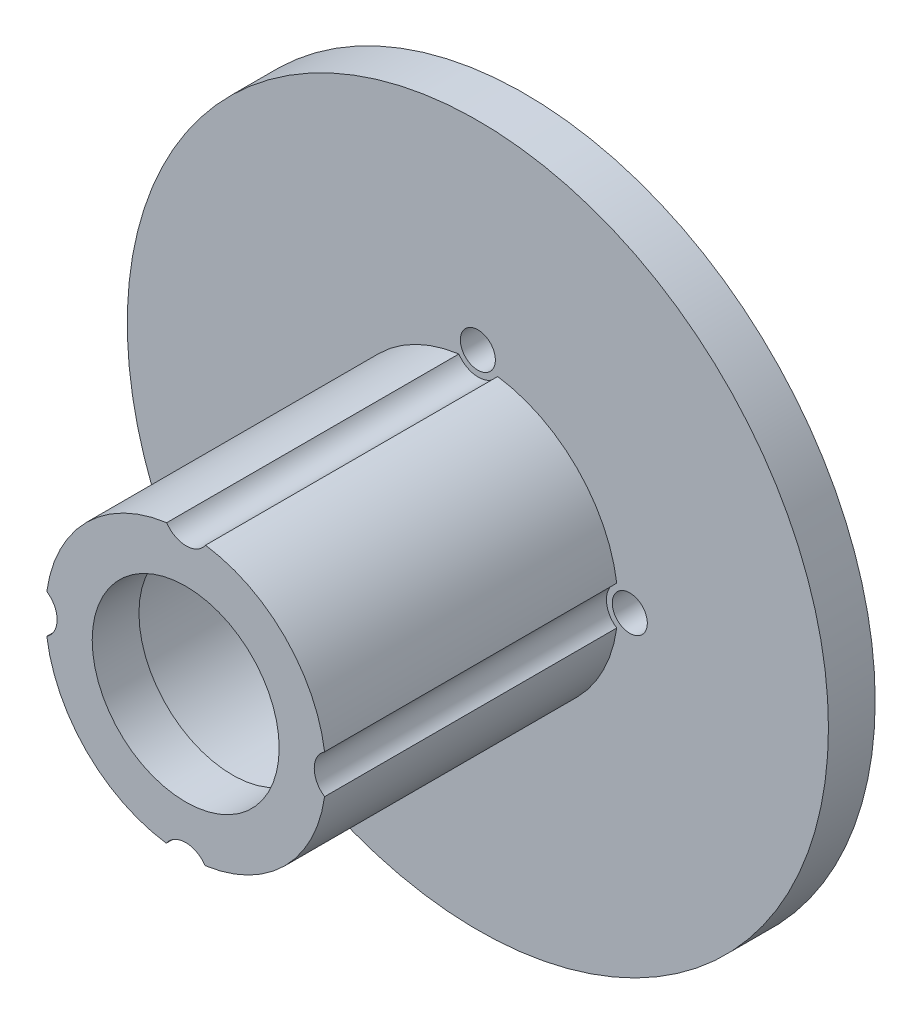
ISO-10303-21;
HEADER;
FILE_DESCRIPTION(('STEP AP214'),'2;1');
FILE_NAME('part.step','',(''),(''),'','','');
FILE_SCHEMA(('AUTOMOTIVE_DESIGN { 1 0 10303 214 1 1 1 1 }'));
ENDSEC;
DATA;
#1=APPLICATION_CONTEXT('core data for automotive mechanical design processes');
#2=APPLICATION_PROTOCOL_DEFINITION('international standard','automotive_design',2000,#1);
#3=PRODUCT_CONTEXT('',#1,'mechanical');
#4=PRODUCT('Part','Part','',(#3));
#5=PRODUCT_RELATED_PRODUCT_CATEGORY('part','',(#4));
#6=PRODUCT_DEFINITION_FORMATION('','',#4);
#7=PRODUCT_DEFINITION_CONTEXT('part definition',#1,'design');
#8=PRODUCT_DEFINITION('design','',#6,#7);
#9=PRODUCT_DEFINITION_SHAPE('','',#8);
#10=(LENGTH_UNIT() NAMED_UNIT(*) SI_UNIT(.MILLI.,.METRE.));
#11=(NAMED_UNIT(*) PLANE_ANGLE_UNIT() SI_UNIT($,.RADIAN.));
#12=(NAMED_UNIT(*) SI_UNIT($,.STERADIAN.) SOLID_ANGLE_UNIT());
#13=UNCERTAINTY_MEASURE_WITH_UNIT(LENGTH_MEASURE(1.E-05),#10,'distance_accuracy_value','');
#14=(GEOMETRIC_REPRESENTATION_CONTEXT(3) GLOBAL_UNCERTAINTY_ASSIGNED_CONTEXT((#13)) GLOBAL_UNIT_ASSIGNED_CONTEXT((#10,
#11,#12)) REPRESENTATION_CONTEXT('',''));
#15=CARTESIAN_POINT('',(0.,0.,0.));
#16=DIRECTION('',(0.,0.,1.));
#17=DIRECTION('',(1.,0.,0.));
#18=AXIS2_PLACEMENT_3D('',#15,#16,#17);
#19=CARTESIAN_POINT('',(0.,0.,29.));
#20=DIRECTION('',(0.,0.,-1.));
#21=DIRECTION('',(-1.,0.,0.));
#22=AXIS2_PLACEMENT_3D('',#19,#20,#21);
#23=CYLINDRICAL_SURFACE('',#22,12.);
#24=CARTESIAN_POINT('',(0.,0.,4.));
#25=DIRECTION('',(0.,0.,1.));
#26=DIRECTION('',(1.,0.,0.));
#27=AXIS2_PLACEMENT_3D('',#24,#25,#26);
#28=CIRCLE('',#27,12.);
#29=CARTESIAN_POINT('',(-11.8846153846154,-1.66009552730056,4.));
#30=VERTEX_POINT('',#29);
#31=CARTESIAN_POINT('',(-1.66009552730056,-11.8846153846154,4.));
#32=VERTEX_POINT('',#31);
#33=EDGE_CURVE('E114',#30,#32,#28,.T.);
#34=ORIENTED_EDGE('',*,*,#33,.T.);
#35=DIRECTION('',(0.,0.,1.));
#36=VECTOR('',#35,1.);
#37=CARTESIAN_POINT('',(-1.66009552730056,-11.8846153846154,16.5));
#38=LINE('',#37,#36);
#39=CARTESIAN_POINT('',(-1.66009552730056,-11.8846153846154,29.));
#40=VERTEX_POINT('',#39);
#41=EDGE_CURVE('E168',#32,#40,#38,.T.);
#42=ORIENTED_EDGE('',*,*,#41,.T.);
#43=CARTESIAN_POINT('',(0.,0.,29.));
#44=DIRECTION('',(0.,0.,1.));
#45=DIRECTION('',(1.,0.,0.));
#46=AXIS2_PLACEMENT_3D('',#43,#44,#45);
#47=CIRCLE('',#46,12.);
#48=CARTESIAN_POINT('',(-11.8846153846154,-1.66009552730056,29.));
#49=VERTEX_POINT('',#48);
#50=EDGE_CURVE('E116',#49,#40,#47,.T.);
#51=ORIENTED_EDGE('',*,*,#50,.F.);
#52=DIRECTION('',(0.,0.,1.));
#53=VECTOR('',#52,1.);
#54=CARTESIAN_POINT('',(-11.8846153846154,-1.66009552730056,16.5));
#55=LINE('',#54,#53);
#56=EDGE_CURVE('E100',#49,#30,#55,.F.);
#57=ORIENTED_EDGE('',*,*,#56,.T.);
#58=EDGE_LOOP('',(#34,#42,#51,#57));
#59=FACE_BOUND('',#58,.T.);
#60=ADVANCED_FACE('F33',(#59),#23,.T.);
#61=CARTESIAN_POINT('',(1.66009552730056,-11.8846153846154,29.));
#62=VERTEX_POINT('',#61);
#63=CARTESIAN_POINT('',(11.8846153846154,-1.66009552730056,29.));
#64=VERTEX_POINT('',#63);
#65=EDGE_CURVE('E151',#62,#64,#47,.T.);
#66=ORIENTED_EDGE('',*,*,#65,.F.);
#67=DIRECTION('',(0.,0.,1.));
#68=VECTOR('',#67,1.);
#69=CARTESIAN_POINT('',(1.66009552730056,-11.8846153846154,16.5));
#70=LINE('',#69,#68);
#71=CARTESIAN_POINT('',(1.66009552730056,-11.8846153846154,4.));
#72=VERTEX_POINT('',#71);
#73=EDGE_CURVE('E162',#62,#72,#70,.F.);
#74=ORIENTED_EDGE('',*,*,#73,.T.);
#75=CARTESIAN_POINT('',(11.8846153846154,-1.66009552730056,4.));
#76=VERTEX_POINT('',#75);
#77=EDGE_CURVE('E124',#72,#76,#28,.T.);
#78=ORIENTED_EDGE('',*,*,#77,.T.);
#79=DIRECTION('',(0.,0.,1.));
#80=VECTOR('',#79,1.);
#81=CARTESIAN_POINT('',(11.8846153846154,-1.66009552730056,16.5));
#82=LINE('',#81,#80);
#83=EDGE_CURVE('E163',#76,#64,#82,.T.);
#84=ORIENTED_EDGE('',*,*,#83,.T.);
#85=EDGE_LOOP('',(#66,#74,#78,#84));
#86=FACE_BOUND('',#85,.T.);
#87=ADVANCED_FACE('F161',(#86),#23,.T.);
#88=CARTESIAN_POINT('',(-1.62358319176585,11.8896584315705,4.));
#89=VERTEX_POINT('',#88);
#90=CARTESIAN_POINT('',(-11.8846153846154,1.66009552730056,4.));
#91=VERTEX_POINT('',#90);
#92=EDGE_CURVE('E123',#89,#91,#28,.T.);
#93=ORIENTED_EDGE('',*,*,#92,.T.);
#94=DIRECTION('',(0.,0.,1.));
#95=VECTOR('',#94,1.);
#96=CARTESIAN_POINT('',(-11.8846153846154,1.66009552730056,16.5));
#97=LINE('',#96,#95);
#98=CARTESIAN_POINT('',(-11.8846153846154,1.66009552730056,29.));
#99=VERTEX_POINT('',#98);
#100=EDGE_CURVE('E103',#91,#99,#97,.T.);
#101=ORIENTED_EDGE('',*,*,#100,.T.);
#102=CARTESIAN_POINT('',(-1.62358319176585,11.8896584315705,29.));
#103=VERTEX_POINT('',#102);
#104=EDGE_CURVE('E146',#103,#99,#47,.T.);
#105=ORIENTED_EDGE('',*,*,#104,.F.);
#106=DIRECTION('',(0.,0.,1.));
#107=VECTOR('',#106,1.);
#108=CARTESIAN_POINT('',(-1.62358319176585,11.8896584315705,16.5));
#109=LINE('',#108,#107);
#110=EDGE_CURVE('E55',#103,#89,#109,.F.);
#111=ORIENTED_EDGE('',*,*,#110,.T.);
#112=EDGE_LOOP('',(#93,#101,#105,#111));
#113=FACE_BOUND('',#112,.T.);
#114=ADVANCED_FACE('F225',(#113),#23,.T.);
#115=CARTESIAN_POINT('',(0.,0.,4.));
#116=DIRECTION('',(0.,0.,-1.));
#117=DIRECTION('',(-1.,0.,0.));
#118=AXIS2_PLACEMENT_3D('',#115,#116,#117);
#119=CYLINDRICAL_SURFACE('',#118,30.);
#120=CARTESIAN_POINT('',(0.,0.,4.));
#121=DIRECTION('',(0.,0.,1.));
#122=DIRECTION('',(1.,0.,0.));
#123=AXIS2_PLACEMENT_3D('',#120,#121,#122);
#124=CIRCLE('',#123,30.);
#125=CARTESIAN_POINT('',(30.,0.,4.));
#126=VERTEX_POINT('',#125);
#127=EDGE_CURVE('E41',#126,#126,#124,.T.);
#128=ORIENTED_EDGE('',*,*,#127,.F.);
#129=EDGE_LOOP('',(#128));
#130=FACE_BOUND('',#129,.T.);
#131=CARTESIAN_POINT('',(0.,0.,0.));
#132=DIRECTION('',(0.,0.,1.));
#133=DIRECTION('',(1.,0.,0.));
#134=AXIS2_PLACEMENT_3D('',#131,#132,#133);
#135=CIRCLE('',#134,30.);
#136=CARTESIAN_POINT('',(30.,0.,0.));
#137=VERTEX_POINT('',#136);
#138=EDGE_CURVE('E148',#137,#137,#135,.T.);
#139=ORIENTED_EDGE('',*,*,#138,.T.);
#140=EDGE_LOOP('',(#139));
#141=FACE_BOUND('',#140,.T.);
#142=ADVANCED_FACE('F35',(#130,#141),#119,.T.);
#143=CARTESIAN_POINT('',(0.,0.,4.));
#144=DIRECTION('',(0.,0.,1.));
#145=DIRECTION('',(1.,0.,0.));
#146=AXIS2_PLACEMENT_3D('',#143,#144,#145);
#147=PLANE('',#146);
#148=ORIENTED_EDGE('',*,*,#77,.F.);
#149=CARTESIAN_POINT('',(0.,-13.,4.));
#150=DIRECTION('',(0.,0.,1.));
#151=DIRECTION('',(1.,0.,0.));
#152=AXIS2_PLACEMENT_3D('',#149,#150,#151);
#153=CIRCLE('',#152,2.);
#154=EDGE_CURVE('E117',#32,#72,#153,.F.);
#155=ORIENTED_EDGE('',*,*,#154,.F.);
#156=ORIENTED_EDGE('',*,*,#33,.F.);
#157=CARTESIAN_POINT('',(-13.,0.,4.));
#158=DIRECTION('',(0.,0.,1.));
#159=DIRECTION('',(1.,0.,0.));
#160=AXIS2_PLACEMENT_3D('',#157,#158,#159);
#161=CIRCLE('',#160,2.);
#162=EDGE_CURVE('E97',#91,#30,#161,.F.);
#163=ORIENTED_EDGE('',*,*,#162,.F.);
#164=ORIENTED_EDGE('',*,*,#92,.F.);
#165=CARTESIAN_POINT('',(0.0398895616682176,13.,4.));
#166=DIRECTION('',(0.,0.,1.));
#167=DIRECTION('',(1.,0.,0.));
#168=AXIS2_PLACEMENT_3D('',#165,#166,#167);
#169=CIRCLE('',#168,2.);
#170=CARTESIAN_POINT('',(1.6965170496129,11.8794709436226,4.));
#171=VERTEX_POINT('',#170);
#172=EDGE_CURVE('E176',#171,#89,#169,.F.);
#173=ORIENTED_EDGE('',*,*,#172,.F.);
#174=CARTESIAN_POINT('',(11.8846153846154,1.66009552730056,4.));
#175=VERTEX_POINT('',#174);
#176=EDGE_CURVE('E126',#175,#171,#28,.T.);
#177=ORIENTED_EDGE('',*,*,#176,.F.);
#178=CARTESIAN_POINT('',(13.,0.,4.));
#179=DIRECTION('',(0.,0.,1.));
#180=DIRECTION('',(1.,0.,0.));
#181=AXIS2_PLACEMENT_3D('',#178,#179,#180);
#182=CIRCLE('',#181,2.);
#183=EDGE_CURVE('E356',#76,#175,#182,.F.);
#184=ORIENTED_EDGE('',*,*,#183,.F.);
#185=EDGE_LOOP('',(#148,#155,#156,#163,#164,#173,#177,#184));
#186=FACE_BOUND('',#185,.T.);
#187=ORIENTED_EDGE('',*,*,#127,.T.);
#188=EDGE_LOOP('',(#187));
#189=FACE_BOUND('',#188,.T.);
#190=CARTESIAN_POINT('',(0.,13.,4.));
#191=DIRECTION('',(0.,0.,-1.));
#192=DIRECTION('',(-1.,0.,0.));
#193=AXIS2_PLACEMENT_3D('',#190,#191,#192);
#194=CIRCLE('',#193,1.5);
#195=CARTESIAN_POINT('',(-1.5,13.,4.));
#196=VERTEX_POINT('',#195);
#197=EDGE_CURVE('E200',#196,#196,#194,.T.);
#198=ORIENTED_EDGE('',*,*,#197,.T.);
#199=EDGE_LOOP('',(#198));
#200=FACE_BOUND('',#199,.T.);
#201=CARTESIAN_POINT('',(-13.0000000000005,4.94961237603754E-13,4.));
#202=DIRECTION('',(0.,0.,-1.));
#203=DIRECTION('',(-1.,0.,0.));
#204=AXIS2_PLACEMENT_3D('',#201,#202,#203);
#205=CIRCLE('',#204,1.5);
#206=CARTESIAN_POINT('',(-14.5000000000005,4.94961237603754E-13,4.));
#207=VERTEX_POINT('',#206);
#208=EDGE_CURVE('E182',#207,#207,#205,.T.);
#209=ORIENTED_EDGE('',*,*,#208,.T.);
#210=EDGE_LOOP('',(#209));
#211=FACE_BOUND('',#210,.T.);
#212=CARTESIAN_POINT('',(12.9999999999995,-4.96553278442646E-13,4.));
#213=DIRECTION('',(0.,0.,-1.));
#214=DIRECTION('',(-1.,0.,0.));
#215=AXIS2_PLACEMENT_3D('',#212,#213,#214);
#216=CIRCLE('',#215,1.5);
#217=CARTESIAN_POINT('',(11.4999999999995,-4.96553278442646E-13,4.));
#218=VERTEX_POINT('',#217);
#219=EDGE_CURVE('E195',#218,#218,#216,.T.);
#220=ORIENTED_EDGE('',*,*,#219,.T.);
#221=EDGE_LOOP('',(#220));
#222=FACE_BOUND('',#221,.T.);
#223=CARTESIAN_POINT('',(-9.89922475207509E-13,-13.,4.));
#224=DIRECTION('',(0.,0.,-1.));
#225=DIRECTION('',(-1.,0.,0.));
#226=AXIS2_PLACEMENT_3D('',#223,#224,#225);
#227=CIRCLE('',#226,1.5);
#228=CARTESIAN_POINT('',(-1.50000000000099,-13.,4.));
#229=VERTEX_POINT('',#228);
#230=EDGE_CURVE('E189',#229,#229,#227,.T.);
#231=ORIENTED_EDGE('',*,*,#230,.T.);
#232=EDGE_LOOP('',(#231));
#233=FACE_BOUND('',#232,.T.);
#234=ADVANCED_FACE('F121',(#186,#189,#200,#211,#222,#233),#147,.T.);
#235=CARTESIAN_POINT('',(0.,0.,0.));
#236=DIRECTION('',(0.,0.,1.));
#237=DIRECTION('',(1.,0.,0.));
#238=AXIS2_PLACEMENT_3D('',#235,#236,#237);
#239=PLANE('',#238);
#240=CARTESIAN_POINT('',(-13.0000000000005,4.94961237603754E-13,0.));
#241=DIRECTION('',(0.,0.,-1.));
#242=DIRECTION('',(-1.,0.,0.));
#243=AXIS2_PLACEMENT_3D('',#240,#241,#242);
#244=CIRCLE('',#243,1.5);
#245=CARTESIAN_POINT('',(-14.5000000000005,4.94961237603754E-13,0.));
#246=VERTEX_POINT('',#245);
#247=EDGE_CURVE('E186',#246,#246,#244,.T.);
#248=ORIENTED_EDGE('',*,*,#247,.F.);
#249=EDGE_LOOP('',(#248));
#250=FACE_BOUND('',#249,.T.);
#251=CARTESIAN_POINT('',(-9.89922475207509E-13,-13.,0.));
#252=DIRECTION('',(0.,0.,-1.));
#253=DIRECTION('',(-1.,0.,0.));
#254=AXIS2_PLACEMENT_3D('',#251,#252,#253);
#255=CIRCLE('',#254,1.5);
#256=CARTESIAN_POINT('',(-1.50000000000099,-13.,0.));
#257=VERTEX_POINT('',#256);
#258=EDGE_CURVE('E192',#257,#257,#255,.T.);
#259=ORIENTED_EDGE('',*,*,#258,.F.);
#260=EDGE_LOOP('',(#259));
#261=FACE_BOUND('',#260,.T.);
#262=CARTESIAN_POINT('',(12.9999999999995,-4.96553278442646E-13,0.));
#263=DIRECTION('',(0.,0.,-1.));
#264=DIRECTION('',(-1.,0.,0.));
#265=AXIS2_PLACEMENT_3D('',#262,#263,#264);
#266=CIRCLE('',#265,1.5);
#267=CARTESIAN_POINT('',(11.4999999999995,-4.96553278442646E-13,0.));
#268=VERTEX_POINT('',#267);
#269=EDGE_CURVE('E181',#268,#268,#266,.T.);
#270=ORIENTED_EDGE('',*,*,#269,.F.);
#271=EDGE_LOOP('',(#270));
#272=FACE_BOUND('',#271,.T.);
#273=CARTESIAN_POINT('',(0.,13.,0.));
#274=DIRECTION('',(0.,0.,-1.));
#275=DIRECTION('',(-1.,0.,0.));
#276=AXIS2_PLACEMENT_3D('',#273,#274,#275);
#277=CIRCLE('',#276,1.5);
#278=CARTESIAN_POINT('',(-1.5,13.,0.));
#279=VERTEX_POINT('',#278);
#280=EDGE_CURVE('E185',#279,#279,#277,.T.);
#281=ORIENTED_EDGE('',*,*,#280,.F.);
#282=EDGE_LOOP('',(#281));
#283=FACE_BOUND('',#282,.T.);
#284=CARTESIAN_POINT('',(0.,0.,0.));
#285=DIRECTION('',(0.,0.,-1.));
#286=DIRECTION('',(-1.,0.,0.));
#287=AXIS2_PLACEMENT_3D('',#284,#285,#286);
#288=CIRCLE('',#287,9.5);
#289=CARTESIAN_POINT('',(-9.5,0.,0.));
#290=VERTEX_POINT('',#289);
#291=EDGE_CURVE('E137',#290,#290,#288,.T.);
#292=ORIENTED_EDGE('',*,*,#291,.F.);
#293=EDGE_LOOP('',(#292));
#294=FACE_BOUND('',#293,.T.);
#295=ORIENTED_EDGE('',*,*,#138,.F.);
#296=EDGE_LOOP('',(#295));
#297=FACE_BOUND('',#296,.T.);
#298=ADVANCED_FACE('F223',(#250,#261,#272,#283,#294,#297),#239,.F.);
#299=CARTESIAN_POINT('',(11.8846153846154,1.66009552730056,29.));
#300=VERTEX_POINT('',#299);
#301=CARTESIAN_POINT('',(1.6965170496129,11.8794709436226,29.));
#302=VERTEX_POINT('',#301);
#303=EDGE_CURVE('E48',#300,#302,#47,.T.);
#304=ORIENTED_EDGE('',*,*,#303,.F.);
#305=DIRECTION('',(0.,0.,1.));
#306=VECTOR('',#305,1.);
#307=CARTESIAN_POINT('',(11.8846153846154,1.66009552730056,16.5));
#308=LINE('',#307,#306);
#309=EDGE_CURVE('E166',#300,#175,#308,.F.);
#310=ORIENTED_EDGE('',*,*,#309,.T.);
#311=ORIENTED_EDGE('',*,*,#176,.T.);
#312=DIRECTION('',(0.,0.,1.));
#313=VECTOR('',#312,1.);
#314=CARTESIAN_POINT('',(1.6965170496129,11.8794709436226,16.5));
#315=LINE('',#314,#313);
#316=EDGE_CURVE('E179',#171,#302,#315,.T.);
#317=ORIENTED_EDGE('',*,*,#316,.T.);
#318=EDGE_LOOP('',(#304,#310,#311,#317));
#319=FACE_BOUND('',#318,.T.);
#320=ADVANCED_FACE('F214',(#319),#23,.T.);
#321=CARTESIAN_POINT('',(0.,0.,29.));
#322=DIRECTION('',(0.,0.,1.));
#323=DIRECTION('',(1.,0.,0.));
#324=AXIS2_PLACEMENT_3D('',#321,#322,#323);
#325=PLANE('',#324);
#326=CARTESIAN_POINT('',(0.,-13.,29.));
#327=DIRECTION('',(0.,0.,1.));
#328=DIRECTION('',(1.,0.,0.));
#329=AXIS2_PLACEMENT_3D('',#326,#327,#328);
#330=CIRCLE('',#329,2.);
#331=EDGE_CURVE('E157',#62,#40,#330,.T.);
#332=ORIENTED_EDGE('',*,*,#331,.F.);
#333=ORIENTED_EDGE('',*,*,#65,.T.);
#334=CARTESIAN_POINT('',(13.,0.,29.));
#335=DIRECTION('',(0.,0.,1.));
#336=DIRECTION('',(1.,0.,0.));
#337=AXIS2_PLACEMENT_3D('',#334,#335,#336);
#338=CIRCLE('',#337,2.);
#339=EDGE_CURVE('E108',#300,#64,#338,.T.);
#340=ORIENTED_EDGE('',*,*,#339,.F.);
#341=ORIENTED_EDGE('',*,*,#303,.T.);
#342=CARTESIAN_POINT('',(0.0398895616682176,13.,29.));
#343=DIRECTION('',(0.,0.,1.));
#344=DIRECTION('',(1.,0.,0.));
#345=AXIS2_PLACEMENT_3D('',#342,#343,#344);
#346=CIRCLE('',#345,2.);
#347=EDGE_CURVE('E174',#103,#302,#346,.T.);
#348=ORIENTED_EDGE('',*,*,#347,.F.);
#349=ORIENTED_EDGE('',*,*,#104,.T.);
#350=CARTESIAN_POINT('',(-13.,0.,29.));
#351=DIRECTION('',(0.,0.,1.));
#352=DIRECTION('',(1.,0.,0.));
#353=AXIS2_PLACEMENT_3D('',#350,#351,#352);
#354=CIRCLE('',#353,2.);
#355=EDGE_CURVE('E11',#49,#99,#354,.T.);
#356=ORIENTED_EDGE('',*,*,#355,.F.);
#357=ORIENTED_EDGE('',*,*,#50,.T.);
#358=EDGE_LOOP('',(#332,#333,#340,#341,#348,#349,#356,#357));
#359=FACE_BOUND('',#358,.T.);
#360=CARTESIAN_POINT('',(0.,0.,29.));
#361=DIRECTION('',(0.,0.,1.));
#362=DIRECTION('',(1.,0.,0.));
#363=AXIS2_PLACEMENT_3D('',#360,#361,#362);
#364=CIRCLE('',#363,8.);
#365=CARTESIAN_POINT('',(8.,0.,29.));
#366=VERTEX_POINT('',#365);
#367=EDGE_CURVE('E142',#366,#366,#364,.T.);
#368=ORIENTED_EDGE('',*,*,#367,.F.);
#369=EDGE_LOOP('',(#368));
#370=FACE_BOUND('',#369,.T.);
#371=ADVANCED_FACE('F155',(#359,#370),#325,.T.);
#372=CARTESIAN_POINT('',(0.,0.,25.));
#373=DIRECTION('',(0.,0.,-1.));
#374=DIRECTION('',(-1.,0.,0.));
#375=AXIS2_PLACEMENT_3D('',#372,#373,#374);
#376=CYLINDRICAL_SURFACE('',#375,9.5);
#377=CARTESIAN_POINT('',(0.,0.,25.));
#378=DIRECTION('',(0.,0.,-1.));
#379=DIRECTION('',(-1.,0.,0.));
#380=AXIS2_PLACEMENT_3D('',#377,#378,#379);
#381=CIRCLE('',#380,9.5);
#382=CARTESIAN_POINT('',(-9.5,0.,25.));
#383=VERTEX_POINT('',#382);
#384=EDGE_CURVE('E130',#383,#383,#381,.T.);
#385=ORIENTED_EDGE('',*,*,#384,.F.);
#386=EDGE_LOOP('',(#385));
#387=FACE_BOUND('',#386,.T.);
#388=ORIENTED_EDGE('',*,*,#291,.T.);
#389=EDGE_LOOP('',(#388));
#390=FACE_BOUND('',#389,.T.);
#391=ADVANCED_FACE('F213',(#387,#390),#376,.F.);
#392=CARTESIAN_POINT('',(0.,0.,25.));
#393=DIRECTION('',(0.,0.,-1.));
#394=DIRECTION('',(-1.,0.,0.));
#395=AXIS2_PLACEMENT_3D('',#392,#393,#394);
#396=PLANE('',#395);
#397=CARTESIAN_POINT('',(0.,0.,25.));
#398=DIRECTION('',(0.,0.,-1.));
#399=DIRECTION('',(-1.,0.,0.));
#400=AXIS2_PLACEMENT_3D('',#397,#398,#399);
#401=CIRCLE('',#400,8.);
#402=CARTESIAN_POINT('',(-8.,0.,25.));
#403=VERTEX_POINT('',#402);
#404=EDGE_CURVE('E203',#403,#403,#401,.T.);
#405=ORIENTED_EDGE('',*,*,#404,.F.);
#406=EDGE_LOOP('',(#405));
#407=FACE_BOUND('',#406,.T.);
#408=ORIENTED_EDGE('',*,*,#384,.T.);
#409=EDGE_LOOP('',(#408));
#410=FACE_BOUND('',#409,.T.);
#411=ADVANCED_FACE('F220',(#407,#410),#396,.T.);
#412=CARTESIAN_POINT('',(0.,0.,45.));
#413=DIRECTION('',(0.,0.,-1.));
#414=DIRECTION('',(-1.,0.,0.));
#415=AXIS2_PLACEMENT_3D('',#412,#413,#414);
#416=CYLINDRICAL_SURFACE('',#415,8.);
#417=ORIENTED_EDGE('',*,*,#367,.T.);
#418=EDGE_LOOP('',(#417));
#419=FACE_BOUND('',#418,.T.);
#420=ORIENTED_EDGE('',*,*,#404,.T.);
#421=EDGE_LOOP('',(#420));
#422=FACE_BOUND('',#421,.T.);
#423=ADVANCED_FACE('F211',(#419,#422),#416,.F.);
#424=CARTESIAN_POINT('',(0.,13.,4.));
#425=DIRECTION('',(0.,0.,-1.));
#426=DIRECTION('',(-1.,0.,0.));
#427=AXIS2_PLACEMENT_3D('',#424,#425,#426);
#428=CYLINDRICAL_SURFACE('',#427,1.5);
#429=ORIENTED_EDGE('',*,*,#197,.F.);
#430=EDGE_LOOP('',(#429));
#431=FACE_BOUND('',#430,.T.);
#432=ORIENTED_EDGE('',*,*,#280,.T.);
#433=EDGE_LOOP('',(#432));
#434=FACE_BOUND('',#433,.T.);
#435=ADVANCED_FACE('F278',(#431,#434),#428,.F.);
#436=CARTESIAN_POINT('',(12.9999999999995,-4.96553278442646E-13,4.));
#437=DIRECTION('',(0.,0.,-1.));
#438=DIRECTION('',(-1.,0.,0.));
#439=AXIS2_PLACEMENT_3D('',#436,#437,#438);
#440=CYLINDRICAL_SURFACE('',#439,1.5);
#441=ORIENTED_EDGE('',*,*,#219,.F.);
#442=EDGE_LOOP('',(#441));
#443=FACE_BOUND('',#442,.T.);
#444=ORIENTED_EDGE('',*,*,#269,.T.);
#445=EDGE_LOOP('',(#444));
#446=FACE_BOUND('',#445,.T.);
#447=ADVANCED_FACE('F269',(#443,#446),#440,.F.);
#448=CARTESIAN_POINT('',(-9.89922475207509E-13,-13.,4.));
#449=DIRECTION('',(0.,0.,-1.));
#450=DIRECTION('',(-1.,0.,0.));
#451=AXIS2_PLACEMENT_3D('',#448,#449,#450);
#452=CYLINDRICAL_SURFACE('',#451,1.5);
#453=ORIENTED_EDGE('',*,*,#230,.F.);
#454=EDGE_LOOP('',(#453));
#455=FACE_BOUND('',#454,.T.);
#456=ORIENTED_EDGE('',*,*,#258,.T.);
#457=EDGE_LOOP('',(#456));
#458=FACE_BOUND('',#457,.T.);
#459=ADVANCED_FACE('F265',(#455,#458),#452,.F.);
#460=CARTESIAN_POINT('',(-13.0000000000005,4.94961237603754E-13,4.));
#461=DIRECTION('',(0.,0.,-1.));
#462=DIRECTION('',(-1.,0.,0.));
#463=AXIS2_PLACEMENT_3D('',#460,#461,#462);
#464=CYLINDRICAL_SURFACE('',#463,1.5);
#465=ORIENTED_EDGE('',*,*,#208,.F.);
#466=EDGE_LOOP('',(#465));
#467=FACE_BOUND('',#466,.T.);
#468=ORIENTED_EDGE('',*,*,#247,.T.);
#469=EDGE_LOOP('',(#468));
#470=FACE_BOUND('',#469,.T.);
#471=ADVANCED_FACE('F268',(#467,#470),#464,.F.);
#472=CARTESIAN_POINT('',(0.0398895616682176,13.,-1.65685424949238));
#473=DIRECTION('',(0.,0.,1.));
#474=DIRECTION('',(1.,0.,0.));
#475=AXIS2_PLACEMENT_3D('',#472,#473,#474);
#476=CYLINDRICAL_SURFACE('',#475,2.);
#477=ORIENTED_EDGE('',*,*,#172,.T.);
#478=ORIENTED_EDGE('',*,*,#110,.F.);
#479=ORIENTED_EDGE('',*,*,#347,.T.);
#480=ORIENTED_EDGE('',*,*,#316,.F.);
#481=EDGE_LOOP('',(#477,#478,#479,#480));
#482=FACE_BOUND('',#481,.T.);
#483=ADVANCED_FACE('F275',(#482),#476,.F.);
#484=CARTESIAN_POINT('',(-13.,0.,-1.65685424949238));
#485=DIRECTION('',(0.,0.,1.));
#486=DIRECTION('',(1.,0.,0.));
#487=AXIS2_PLACEMENT_3D('',#484,#485,#486);
#488=CYLINDRICAL_SURFACE('',#487,2.);
#489=ORIENTED_EDGE('',*,*,#162,.T.);
#490=ORIENTED_EDGE('',*,*,#56,.F.);
#491=ORIENTED_EDGE('',*,*,#355,.T.);
#492=ORIENTED_EDGE('',*,*,#100,.F.);
#493=EDGE_LOOP('',(#489,#490,#491,#492));
#494=FACE_BOUND('',#493,.T.);
#495=ADVANCED_FACE('F99',(#494),#488,.F.);
#496=CARTESIAN_POINT('',(0.,-13.,-1.65685424949238));
#497=DIRECTION('',(0.,0.,1.));
#498=DIRECTION('',(1.,0.,0.));
#499=AXIS2_PLACEMENT_3D('',#496,#497,#498);
#500=CYLINDRICAL_SURFACE('',#499,2.);
#501=ORIENTED_EDGE('',*,*,#154,.T.);
#502=ORIENTED_EDGE('',*,*,#73,.F.);
#503=ORIENTED_EDGE('',*,*,#331,.T.);
#504=ORIENTED_EDGE('',*,*,#41,.F.);
#505=EDGE_LOOP('',(#501,#502,#503,#504));
#506=FACE_BOUND('',#505,.T.);
#507=ADVANCED_FACE('F334',(#506),#500,.F.);
#508=CARTESIAN_POINT('',(13.,0.,-1.65685424949238));
#509=DIRECTION('',(0.,0.,1.));
#510=DIRECTION('',(1.,0.,0.));
#511=AXIS2_PLACEMENT_3D('',#508,#509,#510);
#512=CYLINDRICAL_SURFACE('',#511,2.);
#513=ORIENTED_EDGE('',*,*,#183,.T.);
#514=ORIENTED_EDGE('',*,*,#309,.F.);
#515=ORIENTED_EDGE('',*,*,#339,.T.);
#516=ORIENTED_EDGE('',*,*,#83,.F.);
#517=EDGE_LOOP('',(#513,#514,#515,#516));
#518=FACE_BOUND('',#517,.T.);
#519=ADVANCED_FACE('F343',(#518),#512,.F.);
#520=CLOSED_SHELL('',(#60,#87,#114,#142,#234,#298,#320,#371,#391,#411,#423,#435,#447,#459,#471,
#483,#495,#507,#519));
#521=MANIFOLD_SOLID_BREP('B2',#520);
#522=ADVANCED_BREP_SHAPE_REPRESENTATION('',(#18,#521),#14);
#523=SHAPE_DEFINITION_REPRESENTATION(#9,#522);
ENDSEC;
END-ISO-10303-21;
